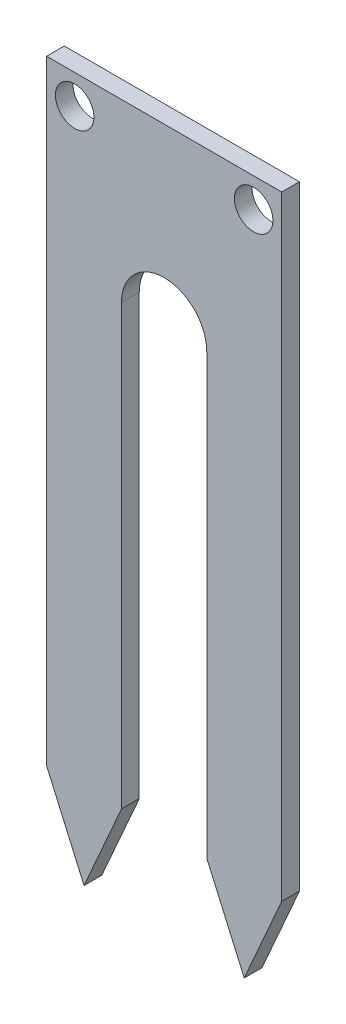
ISO-10303-21;
HEADER;
FILE_DESCRIPTION(('STEP AP214'),'2;1');
FILE_NAME('part.step','',(''),(''),'','','');
FILE_SCHEMA(('AUTOMOTIVE_DESIGN { 1 0 10303 214 1 1 1 1 }'));
ENDSEC;
DATA;
#1=APPLICATION_CONTEXT('core data for automotive mechanical design processes');
#2=APPLICATION_PROTOCOL_DEFINITION('international standard','automotive_design',2000,#1);
#3=PRODUCT_CONTEXT('',#1,'mechanical');
#4=PRODUCT('Part','Part','',(#3));
#5=PRODUCT_RELATED_PRODUCT_CATEGORY('part','',(#4));
#6=PRODUCT_DEFINITION_FORMATION('','',#4);
#7=PRODUCT_DEFINITION_CONTEXT('part definition',#1,'design');
#8=PRODUCT_DEFINITION('design','',#6,#7);
#9=PRODUCT_DEFINITION_SHAPE('','',#8);
#10=(LENGTH_UNIT() NAMED_UNIT(*) SI_UNIT(.MILLI.,.METRE.));
#11=(NAMED_UNIT(*) PLANE_ANGLE_UNIT() SI_UNIT($,.RADIAN.));
#12=(NAMED_UNIT(*) SI_UNIT($,.STERADIAN.) SOLID_ANGLE_UNIT());
#13=UNCERTAINTY_MEASURE_WITH_UNIT(LENGTH_MEASURE(1.E-05),#10,'distance_accuracy_value','');
#14=(GEOMETRIC_REPRESENTATION_CONTEXT(3) GLOBAL_UNCERTAINTY_ASSIGNED_CONTEXT((#13)) GLOBAL_UNIT_ASSIGNED_CONTEXT((#10,
#11,#12)) REPRESENTATION_CONTEXT('',''));
#15=CARTESIAN_POINT('',(0.,0.,0.));
#16=DIRECTION('',(0.,0.,1.));
#17=DIRECTION('',(1.,0.,0.));
#18=AXIS2_PLACEMENT_3D('',#15,#16,#17);
#19=CARTESIAN_POINT('',(20.31,7.35,1.53));
#20=DIRECTION('',(-1.,0.,0.));
#21=DIRECTION('',(0.,0.,1.));
#22=AXIS2_PLACEMENT_3D('',#19,#20,#21);
#23=PLANE('',#22);
#24=DIRECTION('',(0.,1.,0.));
#25=VECTOR('',#24,1.);
#26=CARTESIAN_POINT('',(20.31,7.35,0.));
#27=LINE('',#26,#25);
#28=CARTESIAN_POINT('',(20.31,7.35,0.));
#29=VERTEX_POINT('',#28);
#30=CARTESIAN_POINT('',(20.31,60.41,0.));
#31=VERTEX_POINT('',#30);
#32=EDGE_CURVE('E141',#29,#31,#27,.T.);
#33=ORIENTED_EDGE('',*,*,#32,.T.);
#34=DIRECTION('',(0.,0.,-1.));
#35=VECTOR('',#34,1.);
#36=CARTESIAN_POINT('',(20.31,60.41,1.53));
#37=LINE('',#36,#35);
#38=CARTESIAN_POINT('',(20.31,60.41,1.53));
#39=VERTEX_POINT('',#38);
#40=EDGE_CURVE('E11',#39,#31,#37,.T.);
#41=ORIENTED_EDGE('',*,*,#40,.F.);
#42=DIRECTION('',(0.,1.,0.));
#43=VECTOR('',#42,1.);
#44=CARTESIAN_POINT('',(20.31,7.35,1.53));
#45=LINE('',#44,#43);
#46=CARTESIAN_POINT('',(20.31,7.35,1.53));
#47=VERTEX_POINT('',#46);
#48=EDGE_CURVE('E160',#47,#39,#45,.T.);
#49=ORIENTED_EDGE('',*,*,#48,.F.);
#50=DIRECTION('',(0.,0.,-1.));
#51=VECTOR('',#50,1.);
#52=CARTESIAN_POINT('',(20.31,7.35,1.53));
#53=LINE('',#52,#51);
#54=EDGE_CURVE('E137',#47,#29,#53,.T.);
#55=ORIENTED_EDGE('',*,*,#54,.T.);
#56=EDGE_LOOP('',(#33,#41,#49,#55));
#57=FACE_BOUND('',#56,.T.);
#58=ADVANCED_FACE('F33',(#57),#23,.F.);
#59=CARTESIAN_POINT('',(0.,60.41,1.53));
#60=DIRECTION('',(0.,-1.,0.));
#61=DIRECTION('',(0.,0.,-1.));
#62=AXIS2_PLACEMENT_3D('',#59,#60,#61);
#63=PLANE('',#62);
#64=DIRECTION('',(-1.,0.,0.));
#65=VECTOR('',#64,1.);
#66=CARTESIAN_POINT('',(0.,60.41,0.));
#67=LINE('',#66,#65);
#68=CARTESIAN_POINT('',(0.,60.41,0.));
#69=VERTEX_POINT('',#68);
#70=EDGE_CURVE('E144',#31,#69,#67,.T.);
#71=ORIENTED_EDGE('',*,*,#70,.T.);
#72=DIRECTION('',(0.,0.,-1.));
#73=VECTOR('',#72,1.);
#74=CARTESIAN_POINT('',(0.,60.41,1.53));
#75=LINE('',#74,#73);
#76=CARTESIAN_POINT('',(0.,60.41,1.53));
#77=VERTEX_POINT('',#76);
#78=EDGE_CURVE('E41',#77,#69,#75,.T.);
#79=ORIENTED_EDGE('',*,*,#78,.F.);
#80=DIRECTION('',(-1.,0.,0.));
#81=VECTOR('',#80,1.);
#82=CARTESIAN_POINT('',(0.,60.41,1.53));
#83=LINE('',#82,#81);
#84=EDGE_CURVE('E98',#39,#77,#83,.T.);
#85=ORIENTED_EDGE('',*,*,#84,.F.);
#86=ORIENTED_EDGE('',*,*,#40,.T.);
#87=EDGE_LOOP('',(#71,#79,#85,#86));
#88=FACE_BOUND('',#87,.T.);
#89=ADVANCED_FACE('F243',(#88),#63,.F.);
#90=CARTESIAN_POINT('',(0.,7.35,1.53));
#91=DIRECTION('',(1.,0.,0.));
#92=DIRECTION('',(0.,1.,0.));
#93=AXIS2_PLACEMENT_3D('',#90,#91,#92);
#94=PLANE('',#93);
#95=DIRECTION('',(0.,-1.,0.));
#96=VECTOR('',#95,1.);
#97=CARTESIAN_POINT('',(0.,7.35,0.));
#98=LINE('',#97,#96);
#99=CARTESIAN_POINT('',(0.,7.35,0.));
#100=VERTEX_POINT('',#99);
#101=EDGE_CURVE('E147',#69,#100,#98,.T.);
#102=ORIENTED_EDGE('',*,*,#101,.T.);
#103=DIRECTION('',(0.,0.,-1.));
#104=VECTOR('',#103,1.);
#105=CARTESIAN_POINT('',(0.,7.35,1.53));
#106=LINE('',#105,#104);
#107=CARTESIAN_POINT('',(0.,7.35,1.53));
#108=VERTEX_POINT('',#107);
#109=EDGE_CURVE('E173',#108,#100,#106,.T.);
#110=ORIENTED_EDGE('',*,*,#109,.F.);
#111=DIRECTION('',(0.,-1.,0.));
#112=VECTOR('',#111,1.);
#113=CARTESIAN_POINT('',(0.,7.35,1.53));
#114=LINE('',#113,#112);
#115=EDGE_CURVE('E181',#77,#108,#114,.T.);
#116=ORIENTED_EDGE('',*,*,#115,.F.);
#117=ORIENTED_EDGE('',*,*,#78,.T.);
#118=EDGE_LOOP('',(#102,#110,#116,#117));
#119=FACE_BOUND('',#118,.T.);
#120=ADVANCED_FACE('F179',(#119),#94,.F.);
#121=CARTESIAN_POINT('',(0.,7.35,1.53));
#122=DIRECTION('',(0.915154313980777,0.403103685920104,0.));
#123=DIRECTION('',(-0.403103685920104,0.915154313980777,0.));
#124=AXIS2_PLACEMENT_3D('',#121,#122,#123);
#125=PLANE('',#124);
#126=DIRECTION('',(0.403103685920104,-0.915154313980777,0.));
#127=VECTOR('',#126,1.);
#128=CARTESIAN_POINT('',(0.,7.35,0.));
#129=LINE('',#128,#127);
#130=CARTESIAN_POINT('',(3.2375,0.,0.));
#131=VERTEX_POINT('',#130);
#132=EDGE_CURVE('E149',#100,#131,#129,.T.);
#133=ORIENTED_EDGE('',*,*,#132,.T.);
#134=DIRECTION('',(0.,0.,-1.));
#135=VECTOR('',#134,1.);
#136=CARTESIAN_POINT('',(3.2375,0.,1.53));
#137=LINE('',#136,#135);
#138=CARTESIAN_POINT('',(3.2375,0.,1.53));
#139=VERTEX_POINT('',#138);
#140=EDGE_CURVE('E170',#139,#131,#137,.T.);
#141=ORIENTED_EDGE('',*,*,#140,.F.);
#142=DIRECTION('',(0.403103685920104,-0.915154313980777,0.));
#143=VECTOR('',#142,1.);
#144=CARTESIAN_POINT('',(0.,7.35,1.53));
#145=LINE('',#144,#143);
#146=EDGE_CURVE('E199',#108,#139,#145,.T.);
#147=ORIENTED_EDGE('',*,*,#146,.F.);
#148=ORIENTED_EDGE('',*,*,#109,.T.);
#149=EDGE_LOOP('',(#133,#141,#147,#148));
#150=FACE_BOUND('',#149,.T.);
#151=ADVANCED_FACE('F190',(#150),#125,.F.);
#152=CARTESIAN_POINT('',(3.2375,0.,1.53));
#153=DIRECTION('',(-0.915154313980777,0.403103685920104,0.));
#154=DIRECTION('',(-0.403103685920104,-0.915154313980777,0.));
#155=AXIS2_PLACEMENT_3D('',#152,#153,#154);
#156=PLANE('',#155);
#157=DIRECTION('',(0.403103685920104,0.915154313980777,0.));
#158=VECTOR('',#157,1.);
#159=CARTESIAN_POINT('',(3.2375,0.,0.));
#160=LINE('',#159,#158);
#161=CARTESIAN_POINT('',(6.475,7.35,0.));
#162=VERTEX_POINT('',#161);
#163=EDGE_CURVE('E151',#131,#162,#160,.T.);
#164=ORIENTED_EDGE('',*,*,#163,.T.);
#165=DIRECTION('',(0.,0.,-1.));
#166=VECTOR('',#165,1.);
#167=CARTESIAN_POINT('',(6.475,7.35,1.53));
#168=LINE('',#167,#166);
#169=CARTESIAN_POINT('',(6.475,7.35,1.53));
#170=VERTEX_POINT('',#169);
#171=EDGE_CURVE('E167',#170,#162,#168,.T.);
#172=ORIENTED_EDGE('',*,*,#171,.F.);
#173=DIRECTION('',(0.403103685920104,0.915154313980777,0.));
#174=VECTOR('',#173,1.);
#175=CARTESIAN_POINT('',(3.2375,0.,1.53));
#176=LINE('',#175,#174);
#177=EDGE_CURVE('E196',#139,#170,#176,.T.);
#178=ORIENTED_EDGE('',*,*,#177,.F.);
#179=ORIENTED_EDGE('',*,*,#140,.T.);
#180=EDGE_LOOP('',(#164,#172,#178,#179));
#181=FACE_BOUND('',#180,.T.);
#182=ADVANCED_FACE('F194',(#181),#156,.F.);
#183=CARTESIAN_POINT('',(6.475,45.25,1.53));
#184=DIRECTION('',(-1.,0.,0.));
#185=DIRECTION('',(0.,0.,1.));
#186=AXIS2_PLACEMENT_3D('',#183,#184,#185);
#187=PLANE('',#186);
#188=DIRECTION('',(0.,1.,0.));
#189=VECTOR('',#188,1.);
#190=CARTESIAN_POINT('',(6.475,45.25,0.));
#191=LINE('',#190,#189);
#192=CARTESIAN_POINT('',(6.475,45.25,0.));
#193=VERTEX_POINT('',#192);
#194=EDGE_CURVE('E153',#162,#193,#191,.T.);
#195=ORIENTED_EDGE('',*,*,#194,.T.);
#196=DIRECTION('',(0.,0.,-1.));
#197=VECTOR('',#196,1.);
#198=CARTESIAN_POINT('',(6.475,45.25,1.53));
#199=LINE('',#198,#197);
#200=CARTESIAN_POINT('',(6.475,45.25,1.53));
#201=VERTEX_POINT('',#200);
#202=EDGE_CURVE('E164',#201,#193,#199,.T.);
#203=ORIENTED_EDGE('',*,*,#202,.F.);
#204=DIRECTION('',(0.,1.,0.));
#205=VECTOR('',#204,1.);
#206=CARTESIAN_POINT('',(6.475,45.25,1.53));
#207=LINE('',#206,#205);
#208=EDGE_CURVE('E198',#170,#201,#207,.T.);
#209=ORIENTED_EDGE('',*,*,#208,.F.);
#210=ORIENTED_EDGE('',*,*,#171,.T.);
#211=EDGE_LOOP('',(#195,#203,#209,#210));
#212=FACE_BOUND('',#211,.T.);
#213=ADVANCED_FACE('F255',(#212),#187,.F.);
#214=CARTESIAN_POINT('',(10.155,45.25,1.53));
#215=DIRECTION('',(0.,0.,-1.));
#216=DIRECTION('',(-1.,0.,0.));
#217=AXIS2_PLACEMENT_3D('',#214,#215,#216);
#218=CYLINDRICAL_SURFACE('',#217,3.68);
#219=CARTESIAN_POINT('',(10.155,45.25,0.));
#220=DIRECTION('',(0.,0.,-1.));
#221=DIRECTION('',(1.,0.,0.));
#222=AXIS2_PLACEMENT_3D('',#219,#220,#221);
#223=CIRCLE('',#222,3.68);
#224=CARTESIAN_POINT('',(13.835,45.25,0.));
#225=VERTEX_POINT('',#224);
#226=EDGE_CURVE('E155',#193,#225,#223,.T.);
#227=ORIENTED_EDGE('',*,*,#226,.T.);
#228=DIRECTION('',(0.,0.,-1.));
#229=VECTOR('',#228,1.);
#230=CARTESIAN_POINT('',(13.835,45.25,1.53));
#231=LINE('',#230,#229);
#232=CARTESIAN_POINT('',(13.835,45.25,1.53));
#233=VERTEX_POINT('',#232);
#234=EDGE_CURVE('E132',#233,#225,#231,.T.);
#235=ORIENTED_EDGE('',*,*,#234,.F.);
#236=CARTESIAN_POINT('',(10.155,45.25,1.53));
#237=DIRECTION('',(0.,0.,-1.));
#238=DIRECTION('',(1.,0.,0.));
#239=AXIS2_PLACEMENT_3D('',#236,#237,#238);
#240=CIRCLE('',#239,3.68);
#241=EDGE_CURVE('E123',#201,#233,#240,.T.);
#242=ORIENTED_EDGE('',*,*,#241,.F.);
#243=ORIENTED_EDGE('',*,*,#202,.T.);
#244=EDGE_LOOP('',(#227,#235,#242,#243));
#245=FACE_BOUND('',#244,.T.);
#246=ADVANCED_FACE('F252',(#245),#218,.F.);
#247=CARTESIAN_POINT('',(13.835,45.25,1.53));
#248=DIRECTION('',(1.,0.,0.));
#249=DIRECTION('',(0.,0.,-1.));
#250=AXIS2_PLACEMENT_3D('',#247,#248,#249);
#251=PLANE('',#250);
#252=DIRECTION('',(0.,-1.,0.));
#253=VECTOR('',#252,1.);
#254=CARTESIAN_POINT('',(13.835,45.25,0.));
#255=LINE('',#254,#253);
#256=CARTESIAN_POINT('',(13.835,7.35,0.));
#257=VERTEX_POINT('',#256);
#258=EDGE_CURVE('E131',#225,#257,#255,.T.);
#259=ORIENTED_EDGE('',*,*,#258,.T.);
#260=DIRECTION('',(0.,0.,-1.));
#261=VECTOR('',#260,1.);
#262=CARTESIAN_POINT('',(13.835,7.35,1.53));
#263=LINE('',#262,#261);
#264=CARTESIAN_POINT('',(13.835,7.35,1.53));
#265=VERTEX_POINT('',#264);
#266=EDGE_CURVE('E128',#265,#257,#263,.T.);
#267=ORIENTED_EDGE('',*,*,#266,.F.);
#268=DIRECTION('',(0.,-1.,0.));
#269=VECTOR('',#268,1.);
#270=CARTESIAN_POINT('',(13.835,45.25,1.53));
#271=LINE('',#270,#269);
#272=EDGE_CURVE('E117',#233,#265,#271,.T.);
#273=ORIENTED_EDGE('',*,*,#272,.F.);
#274=ORIENTED_EDGE('',*,*,#234,.T.);
#275=EDGE_LOOP('',(#259,#267,#273,#274));
#276=FACE_BOUND('',#275,.T.);
#277=ADVANCED_FACE('F129',(#276),#251,.F.);
#278=CARTESIAN_POINT('',(17.0725,0.,1.53));
#279=DIRECTION('',(0.915154313980777,0.403103685920104,0.));
#280=DIRECTION('',(-0.403103685920104,0.915154313980777,0.));
#281=AXIS2_PLACEMENT_3D('',#278,#279,#280);
#282=PLANE('',#281);
#283=DIRECTION('',(0.403103685920104,-0.915154313980777,0.));
#284=VECTOR('',#283,1.);
#285=CARTESIAN_POINT('',(17.0725,0.,0.));
#286=LINE('',#285,#284);
#287=CARTESIAN_POINT('',(17.0725,0.,0.));
#288=VERTEX_POINT('',#287);
#289=EDGE_CURVE('E84',#257,#288,#286,.T.);
#290=ORIENTED_EDGE('',*,*,#289,.T.);
#291=DIRECTION('',(0.,0.,-1.));
#292=VECTOR('',#291,1.);
#293=CARTESIAN_POINT('',(17.0725,0.,1.53));
#294=LINE('',#293,#292);
#295=CARTESIAN_POINT('',(17.0725,0.,1.53));
#296=VERTEX_POINT('',#295);
#297=EDGE_CURVE('E133',#296,#288,#294,.T.);
#298=ORIENTED_EDGE('',*,*,#297,.F.);
#299=DIRECTION('',(0.403103685920104,-0.915154313980777,0.));
#300=VECTOR('',#299,1.);
#301=CARTESIAN_POINT('',(17.0725,0.,1.53));
#302=LINE('',#301,#300);
#303=EDGE_CURVE('E121',#265,#296,#302,.T.);
#304=ORIENTED_EDGE('',*,*,#303,.F.);
#305=ORIENTED_EDGE('',*,*,#266,.T.);
#306=EDGE_LOOP('',(#290,#298,#304,#305));
#307=FACE_BOUND('',#306,.T.);
#308=ADVANCED_FACE('F135',(#307),#282,.F.);
#309=CARTESIAN_POINT('',(17.0725,0.,1.53));
#310=DIRECTION('',(-0.915154313980777,0.403103685920104,0.));
#311=DIRECTION('',(-0.403103685920104,-0.915154313980777,0.));
#312=AXIS2_PLACEMENT_3D('',#309,#310,#311);
#313=PLANE('',#312);
#314=DIRECTION('',(0.403103685920104,0.915154313980777,0.));
#315=VECTOR('',#314,1.);
#316=CARTESIAN_POINT('',(17.0725,0.,0.));
#317=LINE('',#316,#315);
#318=EDGE_CURVE('E90',#288,#29,#317,.T.);
#319=ORIENTED_EDGE('',*,*,#318,.T.);
#320=ORIENTED_EDGE('',*,*,#54,.F.);
#321=DIRECTION('',(0.403103685920104,0.915154313980777,0.));
#322=VECTOR('',#321,1.);
#323=CARTESIAN_POINT('',(17.0725,0.,1.53));
#324=LINE('',#323,#322);
#325=EDGE_CURVE('E49',#296,#47,#324,.T.);
#326=ORIENTED_EDGE('',*,*,#325,.F.);
#327=ORIENTED_EDGE('',*,*,#297,.T.);
#328=EDGE_LOOP('',(#319,#320,#326,#327));
#329=FACE_BOUND('',#328,.T.);
#330=ADVANCED_FACE('F230',(#329),#313,.F.);
#331=CARTESIAN_POINT('',(10.155,45.25,1.53));
#332=DIRECTION('',(0.,0.,1.));
#333=DIRECTION('',(1.,0.,0.));
#334=AXIS2_PLACEMENT_3D('',#331,#332,#333);
#335=PLANE('',#334);
#336=CARTESIAN_POINT('',(17.885,57.885,1.53));
#337=DIRECTION('',(0.,0.,1.));
#338=DIRECTION('',(-1.,0.,0.));
#339=AXIS2_PLACEMENT_3D('',#336,#337,#338);
#340=CIRCLE('',#339,1.665);
#341=CARTESIAN_POINT('',(16.22,57.885,1.53));
#342=VERTEX_POINT('',#341);
#343=EDGE_CURVE('E213',#342,#342,#340,.T.);
#344=ORIENTED_EDGE('',*,*,#343,.F.);
#345=EDGE_LOOP('',(#344));
#346=FACE_BOUND('',#345,.T.);
#347=CARTESIAN_POINT('',(2.425,57.885,1.53));
#348=DIRECTION('',(0.,0.,1.));
#349=DIRECTION('',(1.,0.,0.));
#350=AXIS2_PLACEMENT_3D('',#347,#348,#349);
#351=CIRCLE('',#350,1.665);
#352=CARTESIAN_POINT('',(4.09,57.885,1.53));
#353=VERTEX_POINT('',#352);
#354=EDGE_CURVE('E207',#353,#353,#351,.T.);
#355=ORIENTED_EDGE('',*,*,#354,.F.);
#356=EDGE_LOOP('',(#355));
#357=FACE_BOUND('',#356,.T.);
#358=ORIENTED_EDGE('',*,*,#48,.T.);
#359=ORIENTED_EDGE('',*,*,#84,.T.);
#360=ORIENTED_EDGE('',*,*,#115,.T.);
#361=ORIENTED_EDGE('',*,*,#146,.T.);
#362=ORIENTED_EDGE('',*,*,#177,.T.);
#363=ORIENTED_EDGE('',*,*,#208,.T.);
#364=ORIENTED_EDGE('',*,*,#241,.T.);
#365=ORIENTED_EDGE('',*,*,#272,.T.);
#366=ORIENTED_EDGE('',*,*,#303,.T.);
#367=ORIENTED_EDGE('',*,*,#325,.T.);
#368=EDGE_LOOP('',(#358,#359,#360,#361,#362,#363,#364,#365,#366,#367));
#369=FACE_BOUND('',#368,.T.);
#370=ADVANCED_FACE('F119',(#346,#357,#369),#335,.T.);
#371=CARTESIAN_POINT('',(10.155,45.25,0.));
#372=DIRECTION('',(0.,0.,1.));
#373=DIRECTION('',(1.,0.,0.));
#374=AXIS2_PLACEMENT_3D('',#371,#372,#373);
#375=PLANE('',#374);
#376=CARTESIAN_POINT('',(17.885,57.885,0.));
#377=DIRECTION('',(0.,0.,1.));
#378=DIRECTION('',(-1.,0.,0.));
#379=AXIS2_PLACEMENT_3D('',#376,#377,#378);
#380=CIRCLE('',#379,1.665);
#381=CARTESIAN_POINT('',(16.22,57.885,0.));
#382=VERTEX_POINT('',#381);
#383=EDGE_CURVE('E210',#382,#382,#380,.T.);
#384=ORIENTED_EDGE('',*,*,#383,.T.);
#385=EDGE_LOOP('',(#384));
#386=FACE_BOUND('',#385,.T.);
#387=CARTESIAN_POINT('',(2.425,57.885,0.));
#388=DIRECTION('',(0.,0.,1.));
#389=DIRECTION('',(1.,0.,0.));
#390=AXIS2_PLACEMENT_3D('',#387,#388,#389);
#391=CIRCLE('',#390,1.665);
#392=CARTESIAN_POINT('',(4.09,57.885,0.));
#393=VERTEX_POINT('',#392);
#394=EDGE_CURVE('E145',#393,#393,#391,.T.);
#395=ORIENTED_EDGE('',*,*,#394,.T.);
#396=EDGE_LOOP('',(#395));
#397=FACE_BOUND('',#396,.T.);
#398=ORIENTED_EDGE('',*,*,#32,.F.);
#399=ORIENTED_EDGE('',*,*,#318,.F.);
#400=ORIENTED_EDGE('',*,*,#289,.F.);
#401=ORIENTED_EDGE('',*,*,#258,.F.);
#402=ORIENTED_EDGE('',*,*,#226,.F.);
#403=ORIENTED_EDGE('',*,*,#194,.F.);
#404=ORIENTED_EDGE('',*,*,#163,.F.);
#405=ORIENTED_EDGE('',*,*,#132,.F.);
#406=ORIENTED_EDGE('',*,*,#101,.F.);
#407=ORIENTED_EDGE('',*,*,#70,.F.);
#408=EDGE_LOOP('',(#398,#399,#400,#401,#402,#403,#404,#405,#406,#407));
#409=FACE_BOUND('',#408,.T.);
#410=ADVANCED_FACE('F185',(#386,#397,#409),#375,.F.);
#411=CARTESIAN_POINT('',(2.425,57.885,0.));
#412=DIRECTION('',(0.,0.,1.));
#413=DIRECTION('',(1.,0.,0.));
#414=AXIS2_PLACEMENT_3D('',#411,#412,#413);
#415=CYLINDRICAL_SURFACE('',#414,1.665);
#416=ORIENTED_EDGE('',*,*,#394,.F.);
#417=EDGE_LOOP('',(#416));
#418=FACE_BOUND('',#417,.T.);
#419=ORIENTED_EDGE('',*,*,#354,.T.);
#420=EDGE_LOOP('',(#419));
#421=FACE_BOUND('',#420,.T.);
#422=ADVANCED_FACE('F224',(#418,#421),#415,.F.);
#423=CARTESIAN_POINT('',(17.885,57.885,0.));
#424=DIRECTION('',(0.,0.,1.));
#425=DIRECTION('',(1.,0.,0.));
#426=AXIS2_PLACEMENT_3D('',#423,#424,#425);
#427=CYLINDRICAL_SURFACE('',#426,1.665);
#428=ORIENTED_EDGE('',*,*,#383,.F.);
#429=EDGE_LOOP('',(#428));
#430=FACE_BOUND('',#429,.T.);
#431=ORIENTED_EDGE('',*,*,#343,.T.);
#432=EDGE_LOOP('',(#431));
#433=FACE_BOUND('',#432,.T.);
#434=ADVANCED_FACE('F221',(#430,#433),#427,.F.);
#435=CLOSED_SHELL('',(#58,#89,#120,#151,#182,#213,#246,#277,#308,#330,#370,#410,#422,#434));
#436=MANIFOLD_SOLID_BREP('B2',#435);
#437=ADVANCED_BREP_SHAPE_REPRESENTATION('',(#18,#436),#14);
#438=SHAPE_DEFINITION_REPRESENTATION(#9,#437);
ENDSEC;
END-ISO-10303-21;
